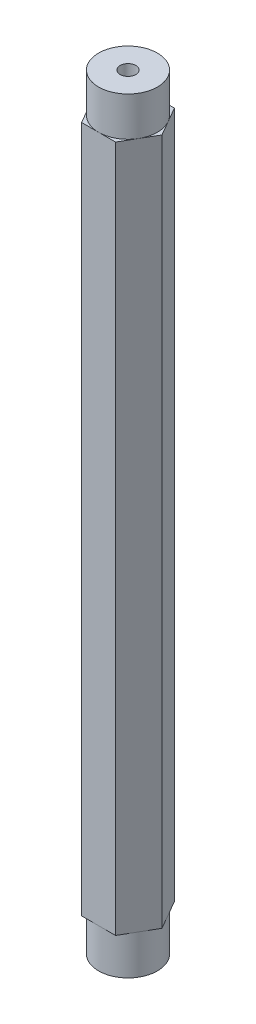
ISO-10303-21;
HEADER;
FILE_DESCRIPTION(('STEP AP214'),'2;1');
FILE_NAME('part.step','',(''),(''),'','','');
FILE_SCHEMA(('AUTOMOTIVE_DESIGN { 1 0 10303 214 1 1 1 1 }'));
ENDSEC;
DATA;
#1=APPLICATION_CONTEXT('core data for automotive mechanical design processes');
#2=APPLICATION_PROTOCOL_DEFINITION('international standard','automotive_design',2000,#1);
#3=PRODUCT_CONTEXT('',#1,'mechanical');
#4=PRODUCT('Part','Part','',(#3));
#5=PRODUCT_RELATED_PRODUCT_CATEGORY('part','',(#4));
#6=PRODUCT_DEFINITION_FORMATION('','',#4);
#7=PRODUCT_DEFINITION_CONTEXT('part definition',#1,'design');
#8=PRODUCT_DEFINITION('design','',#6,#7);
#9=PRODUCT_DEFINITION_SHAPE('','',#8);
#10=(LENGTH_UNIT() NAMED_UNIT(*) SI_UNIT(.MILLI.,.METRE.));
#11=(NAMED_UNIT(*) PLANE_ANGLE_UNIT() SI_UNIT($,.RADIAN.));
#12=(NAMED_UNIT(*) SI_UNIT($,.STERADIAN.) SOLID_ANGLE_UNIT());
#13=UNCERTAINTY_MEASURE_WITH_UNIT(LENGTH_MEASURE(1.E-05),#10,'distance_accuracy_value','');
#14=(GEOMETRIC_REPRESENTATION_CONTEXT(3) GLOBAL_UNCERTAINTY_ASSIGNED_CONTEXT((#13)) GLOBAL_UNIT_ASSIGNED_CONTEXT((#10,
#11,#12)) REPRESENTATION_CONTEXT('',''));
#15=CARTESIAN_POINT('',(0.,0.,0.));
#16=DIRECTION('',(0.,0.,1.));
#17=DIRECTION('',(1.,0.,0.));
#18=AXIS2_PLACEMENT_3D('',#15,#16,#17);
#19=CARTESIAN_POINT('',(0.,-27.813,0.));
#20=DIRECTION('',(0.,1.,0.));
#21=DIRECTION('',(0.,0.,1.));
#22=AXIS2_PLACEMENT_3D('',#19,#20,#21);
#23=PLANE('',#22);
#24=CARTESIAN_POINT('',(0.,-27.813,0.));
#25=DIRECTION('',(0.,-1.,0.));
#26=DIRECTION('',(0.,0.,-1.));
#27=AXIS2_PLACEMENT_3D('',#24,#25,#26);
#28=CIRCLE('',#27,2.38125);
#29=CARTESIAN_POINT('',(0.,-27.813,-2.38125));
#30=VERTEX_POINT('',#29);
#31=CARTESIAN_POINT('',(2.06222299276169,-27.813,-1.190625));
#32=VERTEX_POINT('',#31);
#33=EDGE_CURVE('E51',#30,#32,#28,.T.);
#34=ORIENTED_EDGE('',*,*,#33,.F.);
#35=DIRECTION('',(-1.,0.,0.));
#36=VECTOR('',#35,1.);
#37=CARTESIAN_POINT('',(1.37481532850779,-27.813,-2.38125));
#38=LINE('',#37,#36);
#39=CARTESIAN_POINT('',(1.37481532850779,-27.813,-2.38125));
#40=VERTEX_POINT('',#39);
#41=EDGE_CURVE('E132',#40,#30,#38,.T.);
#42=ORIENTED_EDGE('',*,*,#41,.F.);
#43=DIRECTION('',(-0.5,0.,-0.866025403784439));
#44=VECTOR('',#43,1.);
#45=CARTESIAN_POINT('',(2.74963065701559,-27.813,0.));
#46=LINE('',#45,#44);
#47=EDGE_CURVE('E157',#32,#40,#46,.T.);
#48=ORIENTED_EDGE('',*,*,#47,.F.);
#49=EDGE_LOOP('',(#34,#42,#48));
#50=FACE_BOUND('',#49,.T.);
#51=ADVANCED_FACE('F39',(#50),#23,.F.);
#52=CARTESIAN_POINT('',(2.06222299276169,-27.813,1.190625));
#53=VERTEX_POINT('',#52);
#54=EDGE_CURVE('E11',#32,#53,#28,.T.);
#55=ORIENTED_EDGE('',*,*,#54,.F.);
#56=CARTESIAN_POINT('',(2.74963065701559,-27.813,0.));
#57=VERTEX_POINT('',#56);
#58=EDGE_CURVE('E155',#57,#32,#46,.T.);
#59=ORIENTED_EDGE('',*,*,#58,.F.);
#60=DIRECTION('',(0.5,0.,-0.866025403784439));
#61=VECTOR('',#60,1.);
#62=CARTESIAN_POINT('',(1.3748153285078,-27.813,2.38125));
#63=LINE('',#62,#61);
#64=EDGE_CURVE('E225',#53,#57,#63,.T.);
#65=ORIENTED_EDGE('',*,*,#64,.F.);
#66=EDGE_LOOP('',(#55,#59,#65));
#67=FACE_BOUND('',#66,.T.);
#68=ADVANCED_FACE('F308',(#67),#23,.F.);
#69=CARTESIAN_POINT('',(0.,-27.813,2.38125));
#70=VERTEX_POINT('',#69);
#71=EDGE_CURVE('E49',#53,#70,#28,.T.);
#72=ORIENTED_EDGE('',*,*,#71,.F.);
#73=CARTESIAN_POINT('',(1.3748153285078,-27.813,2.38125));
#74=VERTEX_POINT('',#73);
#75=EDGE_CURVE('E226',#74,#53,#63,.T.);
#76=ORIENTED_EDGE('',*,*,#75,.F.);
#77=DIRECTION('',(1.,0.,0.));
#78=VECTOR('',#77,1.);
#79=CARTESIAN_POINT('',(-1.3748153285078,-27.813,2.38125));
#80=LINE('',#79,#78);
#81=EDGE_CURVE('E186',#70,#74,#80,.T.);
#82=ORIENTED_EDGE('',*,*,#81,.F.);
#83=EDGE_LOOP('',(#72,#76,#82));
#84=FACE_BOUND('',#83,.T.);
#85=ADVANCED_FACE('F313',(#84),#23,.F.);
#86=CARTESIAN_POINT('',(-2.0622229927617,-27.813,1.190625));
#87=VERTEX_POINT('',#86);
#88=EDGE_CURVE('E171',#70,#87,#28,.T.);
#89=ORIENTED_EDGE('',*,*,#88,.F.);
#90=CARTESIAN_POINT('',(-1.3748153285078,-27.813,2.38125));
#91=VERTEX_POINT('',#90);
#92=EDGE_CURVE('E221',#91,#70,#80,.T.);
#93=ORIENTED_EDGE('',*,*,#92,.F.);
#94=DIRECTION('',(0.5,0.,0.866025403784439));
#95=VECTOR('',#94,1.);
#96=CARTESIAN_POINT('',(-2.74963065701559,-27.813,0.));
#97=LINE('',#96,#95);
#98=EDGE_CURVE('E234',#87,#91,#97,.T.);
#99=ORIENTED_EDGE('',*,*,#98,.F.);
#100=EDGE_LOOP('',(#89,#93,#99));
#101=FACE_BOUND('',#100,.T.);
#102=ADVANCED_FACE('F328',(#101),#23,.F.);
#103=CARTESIAN_POINT('',(-2.06222299276169,-27.813,-1.190625));
#104=VERTEX_POINT('',#103);
#105=EDGE_CURVE('E166',#87,#104,#28,.T.);
#106=ORIENTED_EDGE('',*,*,#105,.F.);
#107=CARTESIAN_POINT('',(-2.74963065701559,-27.813,0.));
#108=VERTEX_POINT('',#107);
#109=EDGE_CURVE('E235',#108,#87,#97,.T.);
#110=ORIENTED_EDGE('',*,*,#109,.F.);
#111=DIRECTION('',(-0.5,0.,0.866025403784439));
#112=VECTOR('',#111,1.);
#113=CARTESIAN_POINT('',(-1.3748153285078,-27.813,-2.38125));
#114=LINE('',#113,#112);
#115=EDGE_CURVE('E144',#104,#108,#114,.T.);
#116=ORIENTED_EDGE('',*,*,#115,.F.);
#117=EDGE_LOOP('',(#106,#110,#116));
#118=FACE_BOUND('',#117,.T.);
#119=ADVANCED_FACE('F318',(#118),#23,.F.);
#120=CARTESIAN_POINT('',(0.,27.813,0.));
#121=DIRECTION('',(0.,1.,0.));
#122=DIRECTION('',(0.,0.,1.));
#123=AXIS2_PLACEMENT_3D('',#120,#121,#122);
#124=PLANE('',#123);
#125=CARTESIAN_POINT('',(0.,27.813,0.));
#126=DIRECTION('',(0.,1.,0.));
#127=DIRECTION('',(0.,0.,1.));
#128=AXIS2_PLACEMENT_3D('',#125,#126,#127);
#129=CIRCLE('',#128,2.38125);
#130=CARTESIAN_POINT('',(0.,27.813,2.38125));
#131=VERTEX_POINT('',#130);
#132=CARTESIAN_POINT('',(2.06222299276169,27.813,1.190625));
#133=VERTEX_POINT('',#132);
#134=EDGE_CURVE('E175',#131,#133,#129,.T.);
#135=ORIENTED_EDGE('',*,*,#134,.F.);
#136=DIRECTION('',(1.,0.,0.));
#137=VECTOR('',#136,1.);
#138=CARTESIAN_POINT('',(-1.3748153285078,27.813,2.38125));
#139=LINE('',#138,#137);
#140=CARTESIAN_POINT('',(1.3748153285078,27.813,2.38125));
#141=VERTEX_POINT('',#140);
#142=EDGE_CURVE('E195',#131,#141,#139,.T.);
#143=ORIENTED_EDGE('',*,*,#142,.T.);
#144=DIRECTION('',(0.5,0.,-0.866025403784439));
#145=VECTOR('',#144,1.);
#146=CARTESIAN_POINT('',(1.3748153285078,27.813,2.38125));
#147=LINE('',#146,#145);
#148=EDGE_CURVE('E196',#141,#133,#147,.T.);
#149=ORIENTED_EDGE('',*,*,#148,.T.);
#150=EDGE_LOOP('',(#135,#143,#149));
#151=FACE_BOUND('',#150,.T.);
#152=ADVANCED_FACE('F326',(#151),#124,.T.);
#153=CARTESIAN_POINT('',(2.06222299276169,27.813,-1.190625));
#154=VERTEX_POINT('',#153);
#155=EDGE_CURVE('E168',#133,#154,#129,.T.);
#156=ORIENTED_EDGE('',*,*,#155,.F.);
#157=CARTESIAN_POINT('',(2.74963065701559,27.813,0.));
#158=VERTEX_POINT('',#157);
#159=EDGE_CURVE('E194',#133,#158,#147,.T.);
#160=ORIENTED_EDGE('',*,*,#159,.T.);
#161=DIRECTION('',(-0.5,0.,-0.866025403784439));
#162=VECTOR('',#161,1.);
#163=CARTESIAN_POINT('',(2.74963065701559,27.813,0.));
#164=LINE('',#163,#162);
#165=EDGE_CURVE('E201',#158,#154,#164,.T.);
#166=ORIENTED_EDGE('',*,*,#165,.T.);
#167=EDGE_LOOP('',(#156,#160,#166));
#168=FACE_BOUND('',#167,.T.);
#169=ADVANCED_FACE('F279',(#168),#124,.T.);
#170=CARTESIAN_POINT('',(0.,27.813,-2.38125));
#171=VERTEX_POINT('',#170);
#172=EDGE_CURVE('E173',#154,#171,#129,.T.);
#173=ORIENTED_EDGE('',*,*,#172,.F.);
#174=CARTESIAN_POINT('',(1.37481532850779,27.813,-2.38125));
#175=VERTEX_POINT('',#174);
#176=EDGE_CURVE('E200',#154,#175,#164,.T.);
#177=ORIENTED_EDGE('',*,*,#176,.T.);
#178=DIRECTION('',(-1.,0.,0.));
#179=VECTOR('',#178,1.);
#180=CARTESIAN_POINT('',(1.37481532850779,27.813,-2.38125));
#181=LINE('',#180,#179);
#182=EDGE_CURVE('E206',#175,#171,#181,.T.);
#183=ORIENTED_EDGE('',*,*,#182,.T.);
#184=EDGE_LOOP('',(#173,#177,#183));
#185=FACE_BOUND('',#184,.T.);
#186=ADVANCED_FACE('F275',(#185),#124,.T.);
#187=CARTESIAN_POINT('',(-2.06222299276169,27.813,-1.190625));
#188=VERTEX_POINT('',#187);
#189=EDGE_CURVE('E267',#171,#188,#129,.T.);
#190=ORIENTED_EDGE('',*,*,#189,.F.);
#191=CARTESIAN_POINT('',(-1.3748153285078,27.813,-2.38125));
#192=VERTEX_POINT('',#191);
#193=EDGE_CURVE('E205',#171,#192,#181,.T.);
#194=ORIENTED_EDGE('',*,*,#193,.T.);
#195=DIRECTION('',(-0.5,0.,0.866025403784439));
#196=VECTOR('',#195,1.);
#197=CARTESIAN_POINT('',(-1.3748153285078,27.813,-2.38125));
#198=LINE('',#197,#196);
#199=EDGE_CURVE('E211',#192,#188,#198,.T.);
#200=ORIENTED_EDGE('',*,*,#199,.T.);
#201=EDGE_LOOP('',(#190,#194,#200));
#202=FACE_BOUND('',#201,.T.);
#203=ADVANCED_FACE('F495',(#202),#124,.T.);
#204=CARTESIAN_POINT('',(-2.0622229927617,27.813,1.190625));
#205=VERTEX_POINT('',#204);
#206=EDGE_CURVE('E263',#188,#205,#129,.T.);
#207=ORIENTED_EDGE('',*,*,#206,.F.);
#208=CARTESIAN_POINT('',(-2.74963065701559,27.813,0.));
#209=VERTEX_POINT('',#208);
#210=EDGE_CURVE('E210',#188,#209,#198,.T.);
#211=ORIENTED_EDGE('',*,*,#210,.T.);
#212=DIRECTION('',(0.5,0.,0.866025403784439));
#213=VECTOR('',#212,1.);
#214=CARTESIAN_POINT('',(-2.74963065701559,27.813,0.));
#215=LINE('',#214,#213);
#216=EDGE_CURVE('E216',#209,#205,#215,.T.);
#217=ORIENTED_EDGE('',*,*,#216,.T.);
#218=EDGE_LOOP('',(#207,#211,#217));
#219=FACE_BOUND('',#218,.T.);
#220=ADVANCED_FACE('F324',(#219),#124,.T.);
#221=EDGE_CURVE('E190',#205,#131,#129,.T.);
#222=ORIENTED_EDGE('',*,*,#221,.F.);
#223=CARTESIAN_POINT('',(-1.3748153285078,27.813,2.38125));
#224=VERTEX_POINT('',#223);
#225=EDGE_CURVE('E215',#205,#224,#215,.T.);
#226=ORIENTED_EDGE('',*,*,#225,.T.);
#227=EDGE_CURVE('E191',#224,#131,#139,.T.);
#228=ORIENTED_EDGE('',*,*,#227,.T.);
#229=EDGE_LOOP('',(#222,#226,#228));
#230=FACE_BOUND('',#229,.T.);
#231=ADVANCED_FACE('F317',(#230),#124,.T.);
#232=EDGE_CURVE('E150',#104,#30,#28,.T.);
#233=ORIENTED_EDGE('',*,*,#232,.F.);
#234=CARTESIAN_POINT('',(-1.3748153285078,-27.813,-2.38125));
#235=VERTEX_POINT('',#234);
#236=EDGE_CURVE('E153',#235,#104,#114,.T.);
#237=ORIENTED_EDGE('',*,*,#236,.F.);
#238=EDGE_CURVE('E136',#30,#235,#38,.T.);
#239=ORIENTED_EDGE('',*,*,#238,.F.);
#240=EDGE_LOOP('',(#233,#237,#239));
#241=FACE_BOUND('',#240,.T.);
#242=ADVANCED_FACE('F148',(#241),#23,.F.);
#243=CARTESIAN_POINT('',(-1.3748153285078,27.813,2.38125));
#244=DIRECTION('',(0.,0.,-1.));
#245=DIRECTION('',(-1.,0.,0.));
#246=AXIS2_PLACEMENT_3D('',#243,#244,#245);
#247=PLANE('',#246);
#248=ORIENTED_EDGE('',*,*,#92,.T.);
#249=ORIENTED_EDGE('',*,*,#81,.T.);
#250=DIRECTION('',(0.,-1.,0.));
#251=VECTOR('',#250,1.);
#252=CARTESIAN_POINT('',(1.3748153285078,27.813,2.38125));
#253=LINE('',#252,#251);
#254=EDGE_CURVE('E43',#141,#74,#253,.T.);
#255=ORIENTED_EDGE('',*,*,#254,.F.);
#256=ORIENTED_EDGE('',*,*,#142,.F.);
#257=ORIENTED_EDGE('',*,*,#227,.F.);
#258=DIRECTION('',(0.,-1.,0.));
#259=VECTOR('',#258,1.);
#260=CARTESIAN_POINT('',(-1.3748153285078,27.813,2.38125));
#261=LINE('',#260,#259);
#262=EDGE_CURVE('E220',#224,#91,#261,.T.);
#263=ORIENTED_EDGE('',*,*,#262,.T.);
#264=EDGE_LOOP('',(#248,#249,#255,#256,#257,#263));
#265=FACE_BOUND('',#264,.T.);
#266=ADVANCED_FACE('F41',(#265),#247,.F.);
#267=CARTESIAN_POINT('',(1.3748153285078,27.813,2.38125));
#268=DIRECTION('',(-0.866025403784439,0.,-0.5));
#269=DIRECTION('',(-0.5,0.,0.866025403784439));
#270=AXIS2_PLACEMENT_3D('',#267,#268,#269);
#271=PLANE('',#270);
#272=ORIENTED_EDGE('',*,*,#75,.T.);
#273=ORIENTED_EDGE('',*,*,#64,.T.);
#274=DIRECTION('',(0.,-1.,0.));
#275=VECTOR('',#274,1.);
#276=CARTESIAN_POINT('',(2.74963065701559,27.813,0.));
#277=LINE('',#276,#275);
#278=EDGE_CURVE('E250',#158,#57,#277,.T.);
#279=ORIENTED_EDGE('',*,*,#278,.F.);
#280=ORIENTED_EDGE('',*,*,#159,.F.);
#281=ORIENTED_EDGE('',*,*,#148,.F.);
#282=ORIENTED_EDGE('',*,*,#254,.T.);
#283=EDGE_LOOP('',(#272,#273,#279,#280,#281,#282));
#284=FACE_BOUND('',#283,.T.);
#285=ADVANCED_FACE('F282',(#284),#271,.F.);
#286=CARTESIAN_POINT('',(2.74963065701559,27.813,0.));
#287=DIRECTION('',(-0.866025403784438,0.,0.5));
#288=DIRECTION('',(0.5,0.,0.866025403784439));
#289=AXIS2_PLACEMENT_3D('',#286,#287,#288);
#290=PLANE('',#289);
#291=ORIENTED_EDGE('',*,*,#58,.T.);
#292=ORIENTED_EDGE('',*,*,#47,.T.);
#293=DIRECTION('',(0.,-1.,0.));
#294=VECTOR('',#293,1.);
#295=CARTESIAN_POINT('',(1.37481532850779,27.813,-2.38125));
#296=LINE('',#295,#294);
#297=EDGE_CURVE('E140',#175,#40,#296,.T.);
#298=ORIENTED_EDGE('',*,*,#297,.F.);
#299=ORIENTED_EDGE('',*,*,#176,.F.);
#300=ORIENTED_EDGE('',*,*,#165,.F.);
#301=ORIENTED_EDGE('',*,*,#278,.T.);
#302=EDGE_LOOP('',(#291,#292,#298,#299,#300,#301));
#303=FACE_BOUND('',#302,.T.);
#304=ADVANCED_FACE('F276',(#303),#290,.F.);
#305=CARTESIAN_POINT('',(1.37481532850779,27.813,-2.38125));
#306=DIRECTION('',(0.,0.,1.));
#307=DIRECTION('',(1.,0.,0.));
#308=AXIS2_PLACEMENT_3D('',#305,#306,#307);
#309=PLANE('',#308);
#310=ORIENTED_EDGE('',*,*,#41,.T.);
#311=ORIENTED_EDGE('',*,*,#238,.T.);
#312=DIRECTION('',(0.,-1.,0.));
#313=VECTOR('',#312,1.);
#314=CARTESIAN_POINT('',(-1.3748153285078,27.813,-2.38125));
#315=LINE('',#314,#313);
#316=EDGE_CURVE('E246',#192,#235,#315,.T.);
#317=ORIENTED_EDGE('',*,*,#316,.F.);
#318=ORIENTED_EDGE('',*,*,#193,.F.);
#319=ORIENTED_EDGE('',*,*,#182,.F.);
#320=ORIENTED_EDGE('',*,*,#297,.T.);
#321=EDGE_LOOP('',(#310,#311,#317,#318,#319,#320));
#322=FACE_BOUND('',#321,.T.);
#323=ADVANCED_FACE('F134',(#322),#309,.F.);
#324=CARTESIAN_POINT('',(-1.3748153285078,27.813,-2.38125));
#325=DIRECTION('',(0.866025403784439,0.,0.5));
#326=DIRECTION('',(0.5,0.,-0.866025403784439));
#327=AXIS2_PLACEMENT_3D('',#324,#325,#326);
#328=PLANE('',#327);
#329=ORIENTED_EDGE('',*,*,#236,.T.);
#330=ORIENTED_EDGE('',*,*,#115,.T.);
#331=DIRECTION('',(0.,-1.,0.));
#332=VECTOR('',#331,1.);
#333=CARTESIAN_POINT('',(-2.74963065701559,27.813,0.));
#334=LINE('',#333,#332);
#335=EDGE_CURVE('E242',#209,#108,#334,.T.);
#336=ORIENTED_EDGE('',*,*,#335,.F.);
#337=ORIENTED_EDGE('',*,*,#210,.F.);
#338=ORIENTED_EDGE('',*,*,#199,.F.);
#339=ORIENTED_EDGE('',*,*,#316,.T.);
#340=EDGE_LOOP('',(#329,#330,#336,#337,#338,#339));
#341=FACE_BOUND('',#340,.T.);
#342=ADVANCED_FACE('F350',(#341),#328,.F.);
#343=CARTESIAN_POINT('',(-2.74963065701559,27.813,0.));
#344=DIRECTION('',(0.866025403784438,0.,-0.5));
#345=DIRECTION('',(-0.5,0.,-0.866025403784439));
#346=AXIS2_PLACEMENT_3D('',#343,#344,#345);
#347=PLANE('',#346);
#348=ORIENTED_EDGE('',*,*,#109,.T.);
#349=ORIENTED_EDGE('',*,*,#98,.T.);
#350=ORIENTED_EDGE('',*,*,#262,.F.);
#351=ORIENTED_EDGE('',*,*,#225,.F.);
#352=ORIENTED_EDGE('',*,*,#216,.F.);
#353=ORIENTED_EDGE('',*,*,#335,.T.);
#354=EDGE_LOOP('',(#348,#349,#350,#351,#352,#353));
#355=FACE_BOUND('',#354,.T.);
#356=ADVANCED_FACE('F342',(#355),#347,.F.);
#357=CARTESIAN_POINT('',(0.,27.813,0.));
#358=DIRECTION('',(0.,-1.,0.));
#359=DIRECTION('',(0.,0.,-1.));
#360=AXIS2_PLACEMENT_3D('',#357,#358,#359);
#361=CYLINDRICAL_SURFACE('',#360,0.635);
#362=CARTESIAN_POINT('',(0.,30.988,0.));
#363=DIRECTION('',(0.,1.,0.));
#364=DIRECTION('',(0.,0.,1.));
#365=AXIS2_PLACEMENT_3D('',#362,#363,#364);
#366=CIRCLE('',#365,0.635);
#367=CARTESIAN_POINT('',(0.,30.988,0.635));
#368=VERTEX_POINT('',#367);
#369=EDGE_CURVE('E179',#368,#368,#366,.T.);
#370=ORIENTED_EDGE('',*,*,#369,.T.);
#371=EDGE_LOOP('',(#370));
#372=FACE_BOUND('',#371,.T.);
#373=CARTESIAN_POINT('',(0.,-30.988,0.));
#374=DIRECTION('',(0.,-1.,0.));
#375=DIRECTION('',(0.,0.,-1.));
#376=AXIS2_PLACEMENT_3D('',#373,#374,#375);
#377=CIRCLE('',#376,0.635);
#378=CARTESIAN_POINT('',(0.,-30.988,-0.635));
#379=VERTEX_POINT('',#378);
#380=EDGE_CURVE('E162',#379,#379,#377,.T.);
#381=ORIENTED_EDGE('',*,*,#380,.T.);
#382=EDGE_LOOP('',(#381));
#383=FACE_BOUND('',#382,.T.);
#384=ADVANCED_FACE('F292',(#372,#383),#361,.F.);
#385=CARTESIAN_POINT('',(0.,30.988,0.));
#386=DIRECTION('',(0.,1.,0.));
#387=DIRECTION('',(0.,0.,1.));
#388=AXIS2_PLACEMENT_3D('',#385,#386,#387);
#389=PLANE('',#388);
#390=CARTESIAN_POINT('',(0.,30.988,0.));
#391=DIRECTION('',(0.,1.,0.));
#392=DIRECTION('',(0.,0.,1.));
#393=AXIS2_PLACEMENT_3D('',#390,#391,#392);
#394=CIRCLE('',#393,2.38125);
#395=CARTESIAN_POINT('',(0.,30.988,2.38125));
#396=VERTEX_POINT('',#395);
#397=EDGE_CURVE('E183',#396,#396,#394,.T.);
#398=ORIENTED_EDGE('',*,*,#397,.T.);
#399=EDGE_LOOP('',(#398));
#400=FACE_BOUND('',#399,.T.);
#401=ORIENTED_EDGE('',*,*,#369,.F.);
#402=EDGE_LOOP('',(#401));
#403=FACE_BOUND('',#402,.T.);
#404=ADVANCED_FACE('F304',(#400,#403),#389,.T.);
#405=CARTESIAN_POINT('',(0.,30.988,0.));
#406=DIRECTION('',(0.,-1.,0.));
#407=DIRECTION('',(0.,0.,-1.));
#408=AXIS2_PLACEMENT_3D('',#405,#406,#407);
#409=CYLINDRICAL_SURFACE('',#408,2.38125);
#410=ORIENTED_EDGE('',*,*,#397,.F.);
#411=EDGE_LOOP('',(#410));
#412=FACE_BOUND('',#411,.T.);
#413=ORIENTED_EDGE('',*,*,#134,.T.);
#414=ORIENTED_EDGE('',*,*,#155,.T.);
#415=ORIENTED_EDGE('',*,*,#172,.T.);
#416=ORIENTED_EDGE('',*,*,#189,.T.);
#417=ORIENTED_EDGE('',*,*,#206,.T.);
#418=ORIENTED_EDGE('',*,*,#221,.T.);
#419=EDGE_LOOP('',(#413,#414,#415,#416,#417,#418));
#420=FACE_BOUND('',#419,.T.);
#421=ADVANCED_FACE('F272',(#412,#420),#409,.T.);
#422=CARTESIAN_POINT('',(0.,-30.988,0.));
#423=DIRECTION('',(0.,-1.,0.));
#424=DIRECTION('',(0.,0.,-1.));
#425=AXIS2_PLACEMENT_3D('',#422,#423,#424);
#426=PLANE('',#425);
#427=CARTESIAN_POINT('',(0.,-30.988,0.));
#428=DIRECTION('',(0.,-1.,0.));
#429=DIRECTION('',(0.,0.,-1.));
#430=AXIS2_PLACEMENT_3D('',#427,#428,#429);
#431=CIRCLE('',#430,2.38125);
#432=CARTESIAN_POINT('',(0.,-30.988,-2.38125));
#433=VERTEX_POINT('',#432);
#434=EDGE_CURVE('E161',#433,#433,#431,.T.);
#435=ORIENTED_EDGE('',*,*,#434,.T.);
#436=EDGE_LOOP('',(#435));
#437=FACE_BOUND('',#436,.T.);
#438=ORIENTED_EDGE('',*,*,#380,.F.);
#439=EDGE_LOOP('',(#438));
#440=FACE_BOUND('',#439,.T.);
#441=ADVANCED_FACE('F294',(#437,#440),#426,.T.);
#442=CARTESIAN_POINT('',(0.,-30.988,0.));
#443=DIRECTION('',(0.,1.,0.));
#444=DIRECTION('',(0.,0.,1.));
#445=AXIS2_PLACEMENT_3D('',#442,#443,#444);
#446=CYLINDRICAL_SURFACE('',#445,2.38125);
#447=ORIENTED_EDGE('',*,*,#434,.F.);
#448=EDGE_LOOP('',(#447));
#449=FACE_BOUND('',#448,.T.);
#450=ORIENTED_EDGE('',*,*,#33,.T.);
#451=ORIENTED_EDGE('',*,*,#54,.T.);
#452=ORIENTED_EDGE('',*,*,#71,.T.);
#453=ORIENTED_EDGE('',*,*,#88,.T.);
#454=ORIENTED_EDGE('',*,*,#105,.T.);
#455=ORIENTED_EDGE('',*,*,#232,.T.);
#456=EDGE_LOOP('',(#450,#451,#452,#453,#454,#455));
#457=FACE_BOUND('',#456,.T.);
#458=ADVANCED_FACE('F164',(#449,#457),#446,.T.);
#459=CLOSED_SHELL('',(#51,#68,#85,#102,#119,#152,#169,#186,#203,#220,#231,#242,#266,#285,#304,
#323,#342,#356,#384,#404,#421,#441,#458));
#460=MANIFOLD_SOLID_BREP('B2',#459);
#461=ADVANCED_BREP_SHAPE_REPRESENTATION('',(#18,#460),#14);
#462=SHAPE_DEFINITION_REPRESENTATION(#9,#461);
ENDSEC;
END-ISO-10303-21;
